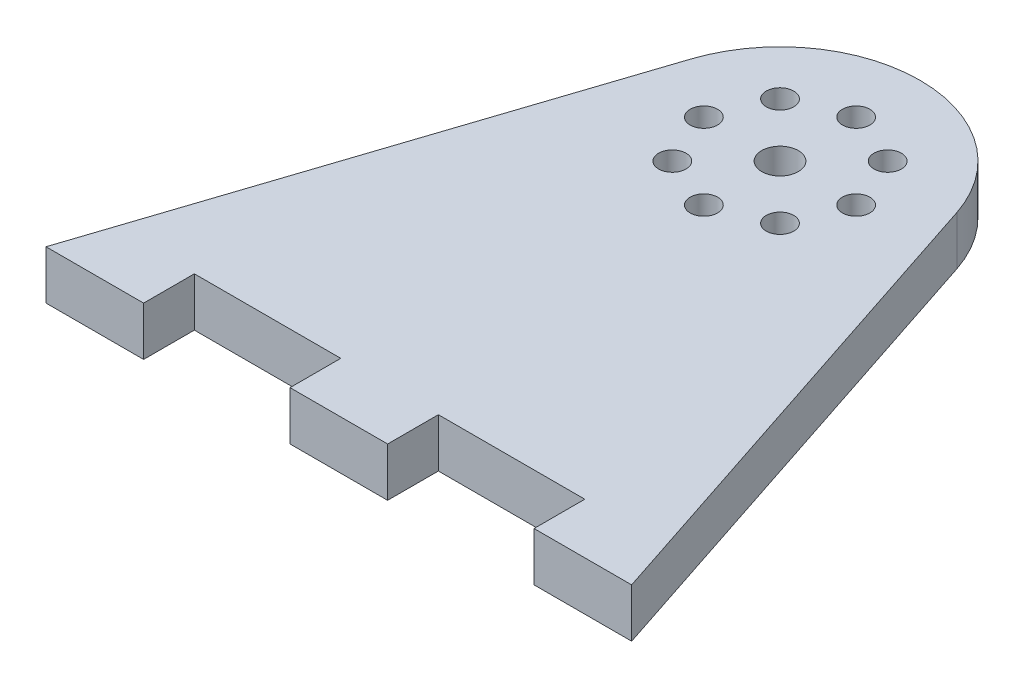
ISO-10303-21;
HEADER;
FILE_DESCRIPTION(('STEP AP214'),'2;1');
FILE_NAME('part.step','',(''),(''),'','','');
FILE_SCHEMA(('AUTOMOTIVE_DESIGN { 1 0 10303 214 1 1 1 1 }'));
ENDSEC;
DATA;
#1=APPLICATION_CONTEXT('core data for automotive mechanical design processes');
#2=APPLICATION_PROTOCOL_DEFINITION('international standard','automotive_design',2000,#1);
#3=PRODUCT_CONTEXT('',#1,'mechanical');
#4=PRODUCT('Part','Part','',(#3));
#5=PRODUCT_RELATED_PRODUCT_CATEGORY('part','',(#4));
#6=PRODUCT_DEFINITION_FORMATION('','',#4);
#7=PRODUCT_DEFINITION_CONTEXT('part definition',#1,'design');
#8=PRODUCT_DEFINITION('design','',#6,#7);
#9=PRODUCT_DEFINITION_SHAPE('','',#8);
#10=(LENGTH_UNIT() NAMED_UNIT(*) SI_UNIT(.MILLI.,.METRE.));
#11=(NAMED_UNIT(*) PLANE_ANGLE_UNIT() SI_UNIT($,.RADIAN.));
#12=(NAMED_UNIT(*) SI_UNIT($,.STERADIAN.) SOLID_ANGLE_UNIT());
#13=UNCERTAINTY_MEASURE_WITH_UNIT(LENGTH_MEASURE(1.E-05),#10,'distance_accuracy_value','');
#14=(GEOMETRIC_REPRESENTATION_CONTEXT(3) GLOBAL_UNCERTAINTY_ASSIGNED_CONTEXT((#13)) GLOBAL_UNIT_ASSIGNED_CONTEXT((#10,
#11,#12)) REPRESENTATION_CONTEXT('',''));
#15=CARTESIAN_POINT('',(0.,0.,0.));
#16=DIRECTION('',(0.,0.,1.));
#17=DIRECTION('',(1.,0.,0.));
#18=AXIS2_PLACEMENT_3D('',#15,#16,#17);
#19=CARTESIAN_POINT('',(0.,6.35,0.));
#20=DIRECTION('',(0.,-1.,0.));
#21=DIRECTION('',(0.,0.,-1.));
#22=AXIS2_PLACEMENT_3D('',#19,#20,#21);
#23=PLANE('',#22);
#24=DIRECTION('',(1.,0.,0.));
#25=VECTOR('',#24,1.);
#26=CARTESIAN_POINT('',(25.4,6.35,50.8));
#27=LINE('',#26,#25);
#28=CARTESIAN_POINT('',(6.35000000000002,6.35,50.8));
#29=VERTEX_POINT('',#28);
#30=CARTESIAN_POINT('',(25.4,6.35,50.8));
#31=VERTEX_POINT('',#30);
#32=EDGE_CURVE('E177',#29,#31,#27,.T.);
#33=ORIENTED_EDGE('',*,*,#32,.T.);
#34=DIRECTION('',(0.,0.,1.));
#35=VECTOR('',#34,1.);
#36=CARTESIAN_POINT('',(25.4,6.35,50.8));
#37=LINE('',#36,#35);
#38=CARTESIAN_POINT('',(25.4,6.35,57.404));
#39=VERTEX_POINT('',#38);
#40=EDGE_CURVE('E105',#31,#39,#37,.T.);
#41=ORIENTED_EDGE('',*,*,#40,.T.);
#42=DIRECTION('',(1.,0.,0.));
#43=VECTOR('',#42,1.);
#44=CARTESIAN_POINT('',(25.4,6.35,57.404));
#45=LINE('',#44,#43);
#46=CARTESIAN_POINT('',(38.1,6.35,57.404));
#47=VERTEX_POINT('',#46);
#48=EDGE_CURVE('E204',#39,#47,#45,.T.);
#49=ORIENTED_EDGE('',*,*,#48,.T.);
#50=DIRECTION('',(-0.312997421123961,0.,-0.949753975706209));
#51=VECTOR('',#50,1.);
#52=CARTESIAN_POINT('',(38.1,6.35,57.404));
#53=LINE('',#52,#51);
#54=CARTESIAN_POINT('',(17.3029242366663,6.35,-5.7022879635253));
#55=VERTEX_POINT('',#54);
#56=EDGE_CURVE('E223',#47,#55,#53,.T.);
#57=ORIENTED_EDGE('',*,*,#56,.T.);
#58=CARTESIAN_POINT('',(0.,6.35,0.));
#59=DIRECTION('',(0.,1.,0.));
#60=DIRECTION('',(0.,0.,-1.));
#61=AXIS2_PLACEMENT_3D('',#58,#59,#60);
#62=CIRCLE('',#61,18.2183225122067);
#63=CARTESIAN_POINT('',(-17.3029242366663,6.35,-5.7022879635253));
#64=VERTEX_POINT('',#63);
#65=EDGE_CURVE('E220',#55,#64,#62,.T.);
#66=ORIENTED_EDGE('',*,*,#65,.T.);
#67=DIRECTION('',(-0.31299742112396,0.,0.949753975706209));
#68=VECTOR('',#67,1.);
#69=CARTESIAN_POINT('',(-38.1,6.35,57.404));
#70=LINE('',#69,#68);
#71=CARTESIAN_POINT('',(-38.1,6.35,57.404));
#72=VERTEX_POINT('',#71);
#73=EDGE_CURVE('E222',#64,#72,#70,.T.);
#74=ORIENTED_EDGE('',*,*,#73,.T.);
#75=DIRECTION('',(1.,0.,0.));
#76=VECTOR('',#75,1.);
#77=CARTESIAN_POINT('',(-38.1,6.35,57.404));
#78=LINE('',#77,#76);
#79=CARTESIAN_POINT('',(-25.4,6.35,57.404));
#80=VERTEX_POINT('',#79);
#81=EDGE_CURVE('E225',#72,#80,#78,.T.);
#82=ORIENTED_EDGE('',*,*,#81,.T.);
#83=DIRECTION('',(0.,0.,-1.));
#84=VECTOR('',#83,1.);
#85=CARTESIAN_POINT('',(-25.4,6.35,50.8));
#86=LINE('',#85,#84);
#87=CARTESIAN_POINT('',(-25.4,6.35,50.8));
#88=VERTEX_POINT('',#87);
#89=EDGE_CURVE('E231',#80,#88,#86,.T.);
#90=ORIENTED_EDGE('',*,*,#89,.T.);
#91=DIRECTION('',(1.,0.,0.));
#92=VECTOR('',#91,1.);
#93=CARTESIAN_POINT('',(-25.4,6.35,50.8));
#94=LINE('',#93,#92);
#95=CARTESIAN_POINT('',(-6.35,6.35,50.8));
#96=VERTEX_POINT('',#95);
#97=EDGE_CURVE('E136',#88,#96,#94,.T.);
#98=ORIENTED_EDGE('',*,*,#97,.T.);
#99=DIRECTION('',(0.,0.,1.));
#100=VECTOR('',#99,1.);
#101=CARTESIAN_POINT('',(-6.35,6.35,50.8));
#102=LINE('',#101,#100);
#103=CARTESIAN_POINT('',(-6.35000000000001,6.35,57.404));
#104=VERTEX_POINT('',#103);
#105=EDGE_CURVE('E130',#96,#104,#102,.T.);
#106=ORIENTED_EDGE('',*,*,#105,.T.);
#107=DIRECTION('',(1.,0.,0.));
#108=VECTOR('',#107,1.);
#109=CARTESIAN_POINT('',(-6.35000000000001,6.35,57.404));
#110=LINE('',#109,#108);
#111=CARTESIAN_POINT('',(6.35000000000002,6.35,57.404));
#112=VERTEX_POINT('',#111);
#113=EDGE_CURVE('E134',#104,#112,#110,.T.);
#114=ORIENTED_EDGE('',*,*,#113,.T.);
#115=DIRECTION('',(0.,0.,-1.));
#116=VECTOR('',#115,1.);
#117=CARTESIAN_POINT('',(6.35000000000002,6.35,50.8));
#118=LINE('',#117,#116);
#119=EDGE_CURVE('E50',#112,#29,#118,.T.);
#120=ORIENTED_EDGE('',*,*,#119,.T.);
#121=EDGE_LOOP('',(#33,#41,#49,#57,#66,#74,#82,#90,#98,#106,#114,#120));
#122=FACE_BOUND('',#121,.T.);
#123=CARTESIAN_POINT('',(0.,6.35,0.));
#124=DIRECTION('',(0.,1.,0.));
#125=DIRECTION('',(0.,0.,1.));
#126=AXIS2_PLACEMENT_3D('',#123,#124,#125);
#127=CIRCLE('',#126,2.38125000000001);
#128=CARTESIAN_POINT('',(0.,6.35,2.38125000000001));
#129=VERTEX_POINT('',#128);
#130=EDGE_CURVE('E158',#129,#129,#127,.T.);
#131=ORIENTED_EDGE('',*,*,#130,.F.);
#132=EDGE_LOOP('',(#131));
#133=FACE_BOUND('',#132,.T.);
#134=CARTESIAN_POINT('',(-9.906,6.35,0.));
#135=DIRECTION('',(0.,1.,0.));
#136=DIRECTION('',(0.,0.,1.));
#137=AXIS2_PLACEMENT_3D('',#134,#135,#136);
#138=CIRCLE('',#137,1.7859375);
#139=CARTESIAN_POINT('',(-9.906,6.35,1.7859375));
#140=VERTEX_POINT('',#139);
#141=EDGE_CURVE('E345',#140,#140,#138,.T.);
#142=ORIENTED_EDGE('',*,*,#141,.F.);
#143=EDGE_LOOP('',(#142));
#144=FACE_BOUND('',#143,.T.);
#145=CARTESIAN_POINT('',(-7.00459977443393,6.35,-7.00459977443395));
#146=DIRECTION('',(0.,1.,0.));
#147=DIRECTION('',(0.,0.,1.));
#148=AXIS2_PLACEMENT_3D('',#145,#146,#147);
#149=CIRCLE('',#148,1.7859375);
#150=CARTESIAN_POINT('',(-7.00459977443393,6.35,-5.21866227443395));
#151=VERTEX_POINT('',#150);
#152=EDGE_CURVE('E339',#151,#151,#149,.T.);
#153=ORIENTED_EDGE('',*,*,#152,.F.);
#154=EDGE_LOOP('',(#153));
#155=FACE_BOUND('',#154,.T.);
#156=CARTESIAN_POINT('',(0.,6.35,-9.906));
#157=DIRECTION('',(0.,1.,0.));
#158=DIRECTION('',(0.,0.,1.));
#159=AXIS2_PLACEMENT_3D('',#156,#157,#158);
#160=CIRCLE('',#159,1.7859375);
#161=CARTESIAN_POINT('',(0.,6.35,-8.1200625));
#162=VERTEX_POINT('',#161);
#163=EDGE_CURVE('E333',#162,#162,#160,.T.);
#164=ORIENTED_EDGE('',*,*,#163,.F.);
#165=EDGE_LOOP('',(#164));
#166=FACE_BOUND('',#165,.T.);
#167=CARTESIAN_POINT('',(7.00459977443398,6.35,-7.0045997744339));
#168=DIRECTION('',(0.,1.,0.));
#169=DIRECTION('',(0.,0.,1.));
#170=AXIS2_PLACEMENT_3D('',#167,#168,#169);
#171=CIRCLE('',#170,1.7859375);
#172=CARTESIAN_POINT('',(7.00459977443398,6.35,-5.2186622744339));
#173=VERTEX_POINT('',#172);
#174=EDGE_CURVE('E327',#173,#173,#171,.T.);
#175=ORIENTED_EDGE('',*,*,#174,.F.);
#176=EDGE_LOOP('',(#175));
#177=FACE_BOUND('',#176,.T.);
#178=CARTESIAN_POINT('',(9.906,6.35,0.));
#179=DIRECTION('',(0.,1.,0.));
#180=DIRECTION('',(0.,0.,1.));
#181=AXIS2_PLACEMENT_3D('',#178,#179,#180);
#182=CIRCLE('',#181,1.7859375);
#183=CARTESIAN_POINT('',(9.906,6.35,1.78593750000007));
#184=VERTEX_POINT('',#183);
#185=EDGE_CURVE('E321',#184,#184,#182,.T.);
#186=ORIENTED_EDGE('',*,*,#185,.F.);
#187=EDGE_LOOP('',(#186));
#188=FACE_BOUND('',#187,.T.);
#189=CARTESIAN_POINT('',(7.00459977443388,6.35,7.004599774434));
#190=DIRECTION('',(0.,1.,0.));
#191=DIRECTION('',(0.,0.,1.));
#192=AXIS2_PLACEMENT_3D('',#189,#190,#191);
#193=CIRCLE('',#192,1.7859375);
#194=CARTESIAN_POINT('',(7.00459977443388,6.35,8.790537274434));
#195=VERTEX_POINT('',#194);
#196=EDGE_CURVE('E315',#195,#195,#193,.T.);
#197=ORIENTED_EDGE('',*,*,#196,.F.);
#198=EDGE_LOOP('',(#197));
#199=FACE_BOUND('',#198,.T.);
#200=CARTESIAN_POINT('',(-1.0375984242774E-13,6.35,9.906));
#201=DIRECTION('',(0.,1.,0.));
#202=DIRECTION('',(0.,0.,1.));
#203=AXIS2_PLACEMENT_3D('',#200,#201,#202);
#204=CIRCLE('',#203,1.7859375);
#205=CARTESIAN_POINT('',(-1.0375984242774E-13,6.35,11.6919375));
#206=VERTEX_POINT('',#205);
#207=EDGE_CURVE('E309',#206,#206,#204,.T.);
#208=ORIENTED_EDGE('',*,*,#207,.F.);
#209=EDGE_LOOP('',(#208));
#210=FACE_BOUND('',#209,.T.);
#211=CARTESIAN_POINT('',(-7.00459977443403,6.35,7.00459977443385));
#212=DIRECTION('',(0.,1.,0.));
#213=DIRECTION('',(0.,0.,1.));
#214=AXIS2_PLACEMENT_3D('',#211,#212,#213);
#215=CIRCLE('',#214,1.7859375);
#216=CARTESIAN_POINT('',(-7.00459977443403,6.35,8.79053727443386));
#217=VERTEX_POINT('',#216);
#218=EDGE_CURVE('E300',#217,#217,#215,.T.);
#219=ORIENTED_EDGE('',*,*,#218,.F.);
#220=EDGE_LOOP('',(#219));
#221=FACE_BOUND('',#220,.T.);
#222=ADVANCED_FACE('F33',(#122,#133,#144,#155,#166,#177,#188,#199,#210,#221),#23,.F.);
#223=CARTESIAN_POINT('',(0.,0.,0.));
#224=DIRECTION('',(0.,-1.,0.));
#225=DIRECTION('',(0.,0.,-1.));
#226=AXIS2_PLACEMENT_3D('',#223,#224,#225);
#227=PLANE('',#226);
#228=CARTESIAN_POINT('',(-1.0375984242774E-13,0.,9.906));
#229=DIRECTION('',(0.,1.,0.));
#230=DIRECTION('',(0.,0.,1.));
#231=AXIS2_PLACEMENT_3D('',#228,#229,#230);
#232=CIRCLE('',#231,1.7859375);
#233=CARTESIAN_POINT('',(-1.0375984242774E-13,0.,11.6919375));
#234=VERTEX_POINT('',#233);
#235=EDGE_CURVE('E306',#234,#234,#232,.T.);
#236=ORIENTED_EDGE('',*,*,#235,.T.);
#237=EDGE_LOOP('',(#236));
#238=FACE_BOUND('',#237,.T.);
#239=CARTESIAN_POINT('',(9.906,0.,0.));
#240=DIRECTION('',(0.,1.,0.));
#241=DIRECTION('',(0.,0.,1.));
#242=AXIS2_PLACEMENT_3D('',#239,#240,#241);
#243=CIRCLE('',#242,1.7859375);
#244=CARTESIAN_POINT('',(9.906,0.,1.78593750000007));
#245=VERTEX_POINT('',#244);
#246=EDGE_CURVE('E318',#245,#245,#243,.T.);
#247=ORIENTED_EDGE('',*,*,#246,.T.);
#248=EDGE_LOOP('',(#247));
#249=FACE_BOUND('',#248,.T.);
#250=CARTESIAN_POINT('',(0.,0.,-9.906));
#251=DIRECTION('',(0.,1.,0.));
#252=DIRECTION('',(0.,0.,1.));
#253=AXIS2_PLACEMENT_3D('',#250,#251,#252);
#254=CIRCLE('',#253,1.7859375);
#255=CARTESIAN_POINT('',(0.,0.,-8.1200625));
#256=VERTEX_POINT('',#255);
#257=EDGE_CURVE('E330',#256,#256,#254,.T.);
#258=ORIENTED_EDGE('',*,*,#257,.T.);
#259=EDGE_LOOP('',(#258));
#260=FACE_BOUND('',#259,.T.);
#261=CARTESIAN_POINT('',(-9.906,0.,0.));
#262=DIRECTION('',(0.,1.,0.));
#263=DIRECTION('',(0.,0.,1.));
#264=AXIS2_PLACEMENT_3D('',#261,#262,#263);
#265=CIRCLE('',#264,1.7859375);
#266=CARTESIAN_POINT('',(-9.906,0.,1.7859375));
#267=VERTEX_POINT('',#266);
#268=EDGE_CURVE('E342',#267,#267,#265,.T.);
#269=ORIENTED_EDGE('',*,*,#268,.T.);
#270=EDGE_LOOP('',(#269));
#271=FACE_BOUND('',#270,.T.);
#272=DIRECTION('',(1.,0.,0.));
#273=VECTOR('',#272,1.);
#274=CARTESIAN_POINT('',(25.4,0.,50.8));
#275=LINE('',#274,#273);
#276=CARTESIAN_POINT('',(6.35000000000002,0.,50.8));
#277=VERTEX_POINT('',#276);
#278=CARTESIAN_POINT('',(25.4,0.,50.8));
#279=VERTEX_POINT('',#278);
#280=EDGE_CURVE('E154',#277,#279,#275,.T.);
#281=ORIENTED_EDGE('',*,*,#280,.F.);
#282=DIRECTION('',(0.,0.,-1.));
#283=VECTOR('',#282,1.);
#284=CARTESIAN_POINT('',(6.35000000000002,0.,50.8));
#285=LINE('',#284,#283);
#286=CARTESIAN_POINT('',(6.35000000000002,0.,57.404));
#287=VERTEX_POINT('',#286);
#288=EDGE_CURVE('E97',#287,#277,#285,.T.);
#289=ORIENTED_EDGE('',*,*,#288,.F.);
#290=DIRECTION('',(1.,0.,0.));
#291=VECTOR('',#290,1.);
#292=CARTESIAN_POINT('',(-6.35000000000001,0.,57.404));
#293=LINE('',#292,#291);
#294=CARTESIAN_POINT('',(-6.35000000000001,0.,57.404));
#295=VERTEX_POINT('',#294);
#296=EDGE_CURVE('E91',#295,#287,#293,.T.);
#297=ORIENTED_EDGE('',*,*,#296,.F.);
#298=DIRECTION('',(0.,0.,1.));
#299=VECTOR('',#298,1.);
#300=CARTESIAN_POINT('',(-6.35,0.,50.8));
#301=LINE('',#300,#299);
#302=CARTESIAN_POINT('',(-6.35,0.,50.8));
#303=VERTEX_POINT('',#302);
#304=EDGE_CURVE('E144',#303,#295,#301,.T.);
#305=ORIENTED_EDGE('',*,*,#304,.F.);
#306=DIRECTION('',(1.,0.,0.));
#307=VECTOR('',#306,1.);
#308=CARTESIAN_POINT('',(-25.4,0.,50.8));
#309=LINE('',#308,#307);
#310=CARTESIAN_POINT('',(-25.4,0.,50.8));
#311=VERTEX_POINT('',#310);
#312=EDGE_CURVE('E172',#311,#303,#309,.T.);
#313=ORIENTED_EDGE('',*,*,#312,.F.);
#314=DIRECTION('',(0.,0.,-1.));
#315=VECTOR('',#314,1.);
#316=CARTESIAN_POINT('',(-25.4,0.,50.8));
#317=LINE('',#316,#315);
#318=CARTESIAN_POINT('',(-25.4,0.,57.404));
#319=VERTEX_POINT('',#318);
#320=EDGE_CURVE('E170',#319,#311,#317,.T.);
#321=ORIENTED_EDGE('',*,*,#320,.F.);
#322=DIRECTION('',(1.,0.,0.));
#323=VECTOR('',#322,1.);
#324=CARTESIAN_POINT('',(-38.1,0.,57.404));
#325=LINE('',#324,#323);
#326=CARTESIAN_POINT('',(-38.1,0.,57.404));
#327=VERTEX_POINT('',#326);
#328=EDGE_CURVE('E168',#327,#319,#325,.T.);
#329=ORIENTED_EDGE('',*,*,#328,.F.);
#330=DIRECTION('',(-0.31299742112396,0.,0.949753975706209));
#331=VECTOR('',#330,1.);
#332=CARTESIAN_POINT('',(-38.1,0.,57.404));
#333=LINE('',#332,#331);
#334=CARTESIAN_POINT('',(-17.3029242366663,0.,-5.7022879635253));
#335=VERTEX_POINT('',#334);
#336=EDGE_CURVE('E166',#335,#327,#333,.T.);
#337=ORIENTED_EDGE('',*,*,#336,.F.);
#338=CARTESIAN_POINT('',(0.,0.,0.));
#339=DIRECTION('',(0.,1.,0.));
#340=DIRECTION('',(0.,0.,-1.));
#341=AXIS2_PLACEMENT_3D('',#338,#339,#340);
#342=CIRCLE('',#341,18.2183225122067);
#343=CARTESIAN_POINT('',(17.3029242366663,0.,-5.7022879635253));
#344=VERTEX_POINT('',#343);
#345=EDGE_CURVE('E164',#344,#335,#342,.T.);
#346=ORIENTED_EDGE('',*,*,#345,.F.);
#347=DIRECTION('',(-0.312997421123961,0.,-0.949753975706209));
#348=VECTOR('',#347,1.);
#349=CARTESIAN_POINT('',(38.1,0.,57.404));
#350=LINE('',#349,#348);
#351=CARTESIAN_POINT('',(38.1,0.,57.404));
#352=VERTEX_POINT('',#351);
#353=EDGE_CURVE('E162',#352,#344,#350,.T.);
#354=ORIENTED_EDGE('',*,*,#353,.F.);
#355=DIRECTION('',(1.,0.,0.));
#356=VECTOR('',#355,1.);
#357=CARTESIAN_POINT('',(25.4,0.,57.404));
#358=LINE('',#357,#356);
#359=CARTESIAN_POINT('',(25.4,0.,57.404));
#360=VERTEX_POINT('',#359);
#361=EDGE_CURVE('E160',#360,#352,#358,.T.);
#362=ORIENTED_EDGE('',*,*,#361,.F.);
#363=DIRECTION('',(0.,0.,1.));
#364=VECTOR('',#363,1.);
#365=CARTESIAN_POINT('',(25.4,0.,50.8));
#366=LINE('',#365,#364);
#367=EDGE_CURVE('E157',#279,#360,#366,.T.);
#368=ORIENTED_EDGE('',*,*,#367,.F.);
#369=EDGE_LOOP('',(#281,#289,#297,#305,#313,#321,#329,#337,#346,#354,#362,#368));
#370=FACE_BOUND('',#369,.T.);
#371=CARTESIAN_POINT('',(0.,0.,0.));
#372=DIRECTION('',(0.,1.,0.));
#373=DIRECTION('',(0.,0.,1.));
#374=AXIS2_PLACEMENT_3D('',#371,#372,#373);
#375=CIRCLE('',#374,2.38125000000001);
#376=CARTESIAN_POINT('',(0.,0.,2.38125000000001));
#377=VERTEX_POINT('',#376);
#378=EDGE_CURVE('E348',#377,#377,#375,.T.);
#379=ORIENTED_EDGE('',*,*,#378,.T.);
#380=EDGE_LOOP('',(#379));
#381=FACE_BOUND('',#380,.T.);
#382=CARTESIAN_POINT('',(-7.00459977443393,0.,-7.00459977443395));
#383=DIRECTION('',(0.,1.,0.));
#384=DIRECTION('',(0.,0.,1.));
#385=AXIS2_PLACEMENT_3D('',#382,#383,#384);
#386=CIRCLE('',#385,1.7859375);
#387=CARTESIAN_POINT('',(-7.00459977443393,0.,-5.21866227443395));
#388=VERTEX_POINT('',#387);
#389=EDGE_CURVE('E336',#388,#388,#386,.T.);
#390=ORIENTED_EDGE('',*,*,#389,.T.);
#391=EDGE_LOOP('',(#390));
#392=FACE_BOUND('',#391,.T.);
#393=CARTESIAN_POINT('',(7.00459977443398,0.,-7.0045997744339));
#394=DIRECTION('',(0.,1.,0.));
#395=DIRECTION('',(0.,0.,1.));
#396=AXIS2_PLACEMENT_3D('',#393,#394,#395);
#397=CIRCLE('',#396,1.7859375);
#398=CARTESIAN_POINT('',(7.00459977443398,0.,-5.2186622744339));
#399=VERTEX_POINT('',#398);
#400=EDGE_CURVE('E324',#399,#399,#397,.T.);
#401=ORIENTED_EDGE('',*,*,#400,.T.);
#402=EDGE_LOOP('',(#401));
#403=FACE_BOUND('',#402,.T.);
#404=CARTESIAN_POINT('',(7.00459977443388,0.,7.004599774434));
#405=DIRECTION('',(0.,1.,0.));
#406=DIRECTION('',(0.,0.,1.));
#407=AXIS2_PLACEMENT_3D('',#404,#405,#406);
#408=CIRCLE('',#407,1.7859375);
#409=CARTESIAN_POINT('',(7.00459977443388,0.,8.790537274434));
#410=VERTEX_POINT('',#409);
#411=EDGE_CURVE('E312',#410,#410,#408,.T.);
#412=ORIENTED_EDGE('',*,*,#411,.T.);
#413=EDGE_LOOP('',(#412));
#414=FACE_BOUND('',#413,.T.);
#415=CARTESIAN_POINT('',(-7.00459977443403,0.,7.00459977443385));
#416=DIRECTION('',(0.,1.,0.));
#417=DIRECTION('',(0.,0.,1.));
#418=AXIS2_PLACEMENT_3D('',#415,#416,#417);
#419=CIRCLE('',#418,1.7859375);
#420=CARTESIAN_POINT('',(-7.00459977443403,0.,8.79053727443386));
#421=VERTEX_POINT('',#420);
#422=EDGE_CURVE('E303',#421,#421,#419,.T.);
#423=ORIENTED_EDGE('',*,*,#422,.T.);
#424=EDGE_LOOP('',(#423));
#425=FACE_BOUND('',#424,.T.);
#426=ADVANCED_FACE('F208',(#238,#249,#260,#271,#370,#381,#392,#403,#414,#425),#227,.T.);
#427=CARTESIAN_POINT('',(25.4,6.35,50.8));
#428=DIRECTION('',(0.,0.,-1.));
#429=DIRECTION('',(-1.,0.,0.));
#430=AXIS2_PLACEMENT_3D('',#427,#428,#429);
#431=PLANE('',#430);
#432=ORIENTED_EDGE('',*,*,#280,.T.);
#433=DIRECTION('',(0.,-1.,0.));
#434=VECTOR('',#433,1.);
#435=CARTESIAN_POINT('',(25.4,6.35,50.8));
#436=LINE('',#435,#434);
#437=EDGE_CURVE('E11',#31,#279,#436,.T.);
#438=ORIENTED_EDGE('',*,*,#437,.F.);
#439=ORIENTED_EDGE('',*,*,#32,.F.);
#440=DIRECTION('',(0.,-1.,0.));
#441=VECTOR('',#440,1.);
#442=CARTESIAN_POINT('',(6.35000000000002,6.35,50.8));
#443=LINE('',#442,#441);
#444=EDGE_CURVE('E150',#29,#277,#443,.T.);
#445=ORIENTED_EDGE('',*,*,#444,.T.);
#446=EDGE_LOOP('',(#432,#438,#439,#445));
#447=FACE_BOUND('',#446,.T.);
#448=ADVANCED_FACE('F35',(#447),#431,.F.);
#449=CARTESIAN_POINT('',(25.4,6.35,50.8));
#450=DIRECTION('',(1.,0.,0.));
#451=DIRECTION('',(0.,0.,-1.));
#452=AXIS2_PLACEMENT_3D('',#449,#450,#451);
#453=PLANE('',#452);
#454=ORIENTED_EDGE('',*,*,#367,.T.);
#455=DIRECTION('',(0.,-1.,0.));
#456=VECTOR('',#455,1.);
#457=CARTESIAN_POINT('',(25.4,6.35,57.404));
#458=LINE('',#457,#456);
#459=EDGE_CURVE('E42',#39,#360,#458,.T.);
#460=ORIENTED_EDGE('',*,*,#459,.F.);
#461=ORIENTED_EDGE('',*,*,#40,.F.);
#462=ORIENTED_EDGE('',*,*,#437,.T.);
#463=EDGE_LOOP('',(#454,#460,#461,#462));
#464=FACE_BOUND('',#463,.T.);
#465=ADVANCED_FACE('F505',(#464),#453,.F.);
#466=CARTESIAN_POINT('',(25.4,6.35,57.404));
#467=DIRECTION('',(0.,0.,-1.));
#468=DIRECTION('',(-1.,0.,0.));
#469=AXIS2_PLACEMENT_3D('',#466,#467,#468);
#470=PLANE('',#469);
#471=ORIENTED_EDGE('',*,*,#361,.T.);
#472=DIRECTION('',(0.,-1.,0.));
#473=VECTOR('',#472,1.);
#474=CARTESIAN_POINT('',(38.1,6.35,57.404));
#475=LINE('',#474,#473);
#476=EDGE_CURVE('E196',#47,#352,#475,.T.);
#477=ORIENTED_EDGE('',*,*,#476,.F.);
#478=ORIENTED_EDGE('',*,*,#48,.F.);
#479=ORIENTED_EDGE('',*,*,#459,.T.);
#480=EDGE_LOOP('',(#471,#477,#478,#479));
#481=FACE_BOUND('',#480,.T.);
#482=ADVANCED_FACE('F202',(#481),#470,.F.);
#483=CARTESIAN_POINT('',(38.1,6.35,57.404));
#484=DIRECTION('',(-0.949753975706209,0.,0.312997421123961));
#485=DIRECTION('',(0.312997421123961,0.,0.949753975706209));
#486=AXIS2_PLACEMENT_3D('',#483,#484,#485);
#487=PLANE('',#486);
#488=ORIENTED_EDGE('',*,*,#353,.T.);
#489=DIRECTION('',(0.,-1.,0.));
#490=VECTOR('',#489,1.);
#491=CARTESIAN_POINT('',(17.3029242366663,6.35,-5.7022879635253));
#492=LINE('',#491,#490);
#493=EDGE_CURVE('E193',#55,#344,#492,.T.);
#494=ORIENTED_EDGE('',*,*,#493,.F.);
#495=ORIENTED_EDGE('',*,*,#56,.F.);
#496=ORIENTED_EDGE('',*,*,#476,.T.);
#497=EDGE_LOOP('',(#488,#494,#495,#496));
#498=FACE_BOUND('',#497,.T.);
#499=ADVANCED_FACE('F214',(#498),#487,.F.);
#500=CARTESIAN_POINT('',(0.,6.35,0.));
#501=DIRECTION('',(0.,-1.,0.));
#502=DIRECTION('',(0.,0.,-1.));
#503=AXIS2_PLACEMENT_3D('',#500,#501,#502);
#504=CYLINDRICAL_SURFACE('',#503,18.2183225122067);
#505=ORIENTED_EDGE('',*,*,#345,.T.);
#506=DIRECTION('',(0.,-1.,0.));
#507=VECTOR('',#506,1.);
#508=CARTESIAN_POINT('',(-17.3029242366663,6.35,-5.7022879635253));
#509=LINE('',#508,#507);
#510=EDGE_CURVE('E190',#64,#335,#509,.T.);
#511=ORIENTED_EDGE('',*,*,#510,.F.);
#512=ORIENTED_EDGE('',*,*,#65,.F.);
#513=ORIENTED_EDGE('',*,*,#493,.T.);
#514=EDGE_LOOP('',(#505,#511,#512,#513));
#515=FACE_BOUND('',#514,.T.);
#516=ADVANCED_FACE('F218',(#515),#504,.T.);
#517=CARTESIAN_POINT('',(-38.1,6.35,57.404));
#518=DIRECTION('',(0.949753975706209,0.,0.31299742112396));
#519=DIRECTION('',(0.312997421123961,0.,-0.949753975706209));
#520=AXIS2_PLACEMENT_3D('',#517,#518,#519);
#521=PLANE('',#520);
#522=ORIENTED_EDGE('',*,*,#336,.T.);
#523=DIRECTION('',(0.,-1.,0.));
#524=VECTOR('',#523,1.);
#525=CARTESIAN_POINT('',(-38.1,6.35,57.404));
#526=LINE('',#525,#524);
#527=EDGE_CURVE('E187',#72,#327,#526,.T.);
#528=ORIENTED_EDGE('',*,*,#527,.F.);
#529=ORIENTED_EDGE('',*,*,#73,.F.);
#530=ORIENTED_EDGE('',*,*,#510,.T.);
#531=EDGE_LOOP('',(#522,#528,#529,#530));
#532=FACE_BOUND('',#531,.T.);
#533=ADVANCED_FACE('F470',(#532),#521,.F.);
#534=CARTESIAN_POINT('',(-38.1,6.35,57.404));
#535=DIRECTION('',(0.,0.,-1.));
#536=DIRECTION('',(-1.,0.,0.));
#537=AXIS2_PLACEMENT_3D('',#534,#535,#536);
#538=PLANE('',#537);
#539=ORIENTED_EDGE('',*,*,#328,.T.);
#540=DIRECTION('',(0.,-1.,0.));
#541=VECTOR('',#540,1.);
#542=CARTESIAN_POINT('',(-25.4,6.35,57.404));
#543=LINE('',#542,#541);
#544=EDGE_CURVE('E184',#80,#319,#543,.T.);
#545=ORIENTED_EDGE('',*,*,#544,.F.);
#546=ORIENTED_EDGE('',*,*,#81,.F.);
#547=ORIENTED_EDGE('',*,*,#527,.T.);
#548=EDGE_LOOP('',(#539,#545,#546,#547));
#549=FACE_BOUND('',#548,.T.);
#550=ADVANCED_FACE('F461',(#549),#538,.F.);
#551=CARTESIAN_POINT('',(-25.4,6.35,50.8));
#552=DIRECTION('',(-1.,0.,0.));
#553=DIRECTION('',(0.,0.,1.));
#554=AXIS2_PLACEMENT_3D('',#551,#552,#553);
#555=PLANE('',#554);
#556=ORIENTED_EDGE('',*,*,#320,.T.);
#557=DIRECTION('',(0.,-1.,0.));
#558=VECTOR('',#557,1.);
#559=CARTESIAN_POINT('',(-25.4,6.35,50.8));
#560=LINE('',#559,#558);
#561=EDGE_CURVE('E181',#88,#311,#560,.T.);
#562=ORIENTED_EDGE('',*,*,#561,.F.);
#563=ORIENTED_EDGE('',*,*,#89,.F.);
#564=ORIENTED_EDGE('',*,*,#544,.T.);
#565=EDGE_LOOP('',(#556,#562,#563,#564));
#566=FACE_BOUND('',#565,.T.);
#567=ADVANCED_FACE('F237',(#566),#555,.F.);
#568=CARTESIAN_POINT('',(-25.4,6.35,50.8));
#569=DIRECTION('',(0.,0.,-1.));
#570=DIRECTION('',(-1.,0.,0.));
#571=AXIS2_PLACEMENT_3D('',#568,#569,#570);
#572=PLANE('',#571);
#573=ORIENTED_EDGE('',*,*,#312,.T.);
#574=DIRECTION('',(0.,-1.,0.));
#575=VECTOR('',#574,1.);
#576=CARTESIAN_POINT('',(-6.35,6.35,50.8));
#577=LINE('',#576,#575);
#578=EDGE_CURVE('E145',#96,#303,#577,.T.);
#579=ORIENTED_EDGE('',*,*,#578,.F.);
#580=ORIENTED_EDGE('',*,*,#97,.F.);
#581=ORIENTED_EDGE('',*,*,#561,.T.);
#582=EDGE_LOOP('',(#573,#579,#580,#581));
#583=FACE_BOUND('',#582,.T.);
#584=ADVANCED_FACE('F241',(#583),#572,.F.);
#585=CARTESIAN_POINT('',(-6.35,6.35,50.8));
#586=DIRECTION('',(1.,0.,0.));
#587=DIRECTION('',(0.,0.,-1.));
#588=AXIS2_PLACEMENT_3D('',#585,#586,#587);
#589=PLANE('',#588);
#590=ORIENTED_EDGE('',*,*,#304,.T.);
#591=DIRECTION('',(0.,-1.,0.));
#592=VECTOR('',#591,1.);
#593=CARTESIAN_POINT('',(-6.35000000000001,6.35,57.404));
#594=LINE('',#593,#592);
#595=EDGE_CURVE('E141',#104,#295,#594,.T.);
#596=ORIENTED_EDGE('',*,*,#595,.F.);
#597=ORIENTED_EDGE('',*,*,#105,.F.);
#598=ORIENTED_EDGE('',*,*,#578,.T.);
#599=EDGE_LOOP('',(#590,#596,#597,#598));
#600=FACE_BOUND('',#599,.T.);
#601=ADVANCED_FACE('F142',(#600),#589,.F.);
#602=CARTESIAN_POINT('',(-6.35000000000001,6.35,57.404));
#603=DIRECTION('',(0.,0.,-1.));
#604=DIRECTION('',(-1.,0.,0.));
#605=AXIS2_PLACEMENT_3D('',#602,#603,#604);
#606=PLANE('',#605);
#607=ORIENTED_EDGE('',*,*,#296,.T.);
#608=DIRECTION('',(0.,-1.,0.));
#609=VECTOR('',#608,1.);
#610=CARTESIAN_POINT('',(6.35000000000002,6.35,57.404));
#611=LINE('',#610,#609);
#612=EDGE_CURVE('E146',#112,#287,#611,.T.);
#613=ORIENTED_EDGE('',*,*,#612,.F.);
#614=ORIENTED_EDGE('',*,*,#113,.F.);
#615=ORIENTED_EDGE('',*,*,#595,.T.);
#616=EDGE_LOOP('',(#607,#613,#614,#615));
#617=FACE_BOUND('',#616,.T.);
#618=ADVANCED_FACE('F148',(#617),#606,.F.);
#619=CARTESIAN_POINT('',(6.35000000000002,6.35,50.8));
#620=DIRECTION('',(-1.,0.,0.));
#621=DIRECTION('',(0.,0.,1.));
#622=AXIS2_PLACEMENT_3D('',#619,#620,#621);
#623=PLANE('',#622);
#624=ORIENTED_EDGE('',*,*,#288,.T.);
#625=ORIENTED_EDGE('',*,*,#444,.F.);
#626=ORIENTED_EDGE('',*,*,#119,.F.);
#627=ORIENTED_EDGE('',*,*,#612,.T.);
#628=EDGE_LOOP('',(#624,#625,#626,#627));
#629=FACE_BOUND('',#628,.T.);
#630=ADVANCED_FACE('F245',(#629),#623,.F.);
#631=CARTESIAN_POINT('',(0.,6.35,0.));
#632=DIRECTION('',(0.,-1.,0.));
#633=DIRECTION('',(0.,0.,-1.));
#634=AXIS2_PLACEMENT_3D('',#631,#632,#633);
#635=CYLINDRICAL_SURFACE('',#634,2.38125000000001);
#636=ORIENTED_EDGE('',*,*,#130,.T.);
#637=EDGE_LOOP('',(#636));
#638=FACE_BOUND('',#637,.T.);
#639=ORIENTED_EDGE('',*,*,#378,.F.);
#640=EDGE_LOOP('',(#639));
#641=FACE_BOUND('',#640,.T.);
#642=ADVANCED_FACE('F247',(#638,#641),#635,.F.);
#643=CARTESIAN_POINT('',(-9.906,6.35,0.));
#644=DIRECTION('',(0.,-1.,0.));
#645=DIRECTION('',(0.,0.,-1.));
#646=AXIS2_PLACEMENT_3D('',#643,#644,#645);
#647=CYLINDRICAL_SURFACE('',#646,1.7859375);
#648=ORIENTED_EDGE('',*,*,#141,.T.);
#649=EDGE_LOOP('',(#648));
#650=FACE_BOUND('',#649,.T.);
#651=ORIENTED_EDGE('',*,*,#268,.F.);
#652=EDGE_LOOP('',(#651));
#653=FACE_BOUND('',#652,.T.);
#654=ADVANCED_FACE('F253',(#650,#653),#647,.F.);
#655=CARTESIAN_POINT('',(-7.00459977443393,6.35,-7.00459977443395));
#656=DIRECTION('',(0.,-1.,0.));
#657=DIRECTION('',(0.,0.,-1.));
#658=AXIS2_PLACEMENT_3D('',#655,#656,#657);
#659=CYLINDRICAL_SURFACE('',#658,1.7859375);
#660=ORIENTED_EDGE('',*,*,#152,.T.);
#661=EDGE_LOOP('',(#660));
#662=FACE_BOUND('',#661,.T.);
#663=ORIENTED_EDGE('',*,*,#389,.F.);
#664=EDGE_LOOP('',(#663));
#665=FACE_BOUND('',#664,.T.);
#666=ADVANCED_FACE('F267',(#662,#665),#659,.F.);
#667=CARTESIAN_POINT('',(0.,6.35,-9.906));
#668=DIRECTION('',(0.,-1.,0.));
#669=DIRECTION('',(0.,0.,-1.));
#670=AXIS2_PLACEMENT_3D('',#667,#668,#669);
#671=CYLINDRICAL_SURFACE('',#670,1.7859375);
#672=ORIENTED_EDGE('',*,*,#163,.T.);
#673=EDGE_LOOP('',(#672));
#674=FACE_BOUND('',#673,.T.);
#675=ORIENTED_EDGE('',*,*,#257,.F.);
#676=EDGE_LOOP('',(#675));
#677=FACE_BOUND('',#676,.T.);
#678=ADVANCED_FACE('F271',(#674,#677),#671,.F.);
#679=CARTESIAN_POINT('',(7.00459977443398,6.35,-7.0045997744339));
#680=DIRECTION('',(0.,-1.,0.));
#681=DIRECTION('',(0.,0.,-1.));
#682=AXIS2_PLACEMENT_3D('',#679,#680,#681);
#683=CYLINDRICAL_SURFACE('',#682,1.7859375);
#684=ORIENTED_EDGE('',*,*,#174,.T.);
#685=EDGE_LOOP('',(#684));
#686=FACE_BOUND('',#685,.T.);
#687=ORIENTED_EDGE('',*,*,#400,.F.);
#688=EDGE_LOOP('',(#687));
#689=FACE_BOUND('',#688,.T.);
#690=ADVANCED_FACE('F275',(#686,#689),#683,.F.);
#691=CARTESIAN_POINT('',(9.906,6.35,0.));
#692=DIRECTION('',(0.,-1.,0.));
#693=DIRECTION('',(0.,0.,-1.));
#694=AXIS2_PLACEMENT_3D('',#691,#692,#693);
#695=CYLINDRICAL_SURFACE('',#694,1.7859375);
#696=ORIENTED_EDGE('',*,*,#185,.T.);
#697=EDGE_LOOP('',(#696));
#698=FACE_BOUND('',#697,.T.);
#699=ORIENTED_EDGE('',*,*,#246,.F.);
#700=EDGE_LOOP('',(#699));
#701=FACE_BOUND('',#700,.T.);
#702=ADVANCED_FACE('F279',(#698,#701),#695,.F.);
#703=CARTESIAN_POINT('',(7.00459977443388,6.35,7.004599774434));
#704=DIRECTION('',(0.,-1.,0.));
#705=DIRECTION('',(0.,0.,-1.));
#706=AXIS2_PLACEMENT_3D('',#703,#704,#705);
#707=CYLINDRICAL_SURFACE('',#706,1.7859375);
#708=ORIENTED_EDGE('',*,*,#196,.T.);
#709=EDGE_LOOP('',(#708));
#710=FACE_BOUND('',#709,.T.);
#711=ORIENTED_EDGE('',*,*,#411,.F.);
#712=EDGE_LOOP('',(#711));
#713=FACE_BOUND('',#712,.T.);
#714=ADVANCED_FACE('F283',(#710,#713),#707,.F.);
#715=CARTESIAN_POINT('',(-1.0375984242774E-13,6.35,9.906));
#716=DIRECTION('',(0.,-1.,0.));
#717=DIRECTION('',(0.,0.,-1.));
#718=AXIS2_PLACEMENT_3D('',#715,#716,#717);
#719=CYLINDRICAL_SURFACE('',#718,1.7859375);
#720=ORIENTED_EDGE('',*,*,#207,.T.);
#721=EDGE_LOOP('',(#720));
#722=FACE_BOUND('',#721,.T.);
#723=ORIENTED_EDGE('',*,*,#235,.F.);
#724=EDGE_LOOP('',(#723));
#725=FACE_BOUND('',#724,.T.);
#726=ADVANCED_FACE('F287',(#722,#725),#719,.F.);
#727=CARTESIAN_POINT('',(-7.00459977443403,6.35,7.00459977443385));
#728=DIRECTION('',(0.,-1.,0.));
#729=DIRECTION('',(0.,0.,-1.));
#730=AXIS2_PLACEMENT_3D('',#727,#728,#729);
#731=CYLINDRICAL_SURFACE('',#730,1.7859375);
#732=ORIENTED_EDGE('',*,*,#218,.T.);
#733=EDGE_LOOP('',(#732));
#734=FACE_BOUND('',#733,.T.);
#735=ORIENTED_EDGE('',*,*,#422,.F.);
#736=EDGE_LOOP('',(#735));
#737=FACE_BOUND('',#736,.T.);
#738=ADVANCED_FACE('F291',(#734,#737),#731,.F.);
#739=CLOSED_SHELL('',(#222,#426,#448,#465,#482,#499,#516,#533,#550,#567,#584,#601,#618,#630,
#642,#654,#666,#678,#690,#702,#714,#726,#738));
#740=MANIFOLD_SOLID_BREP('B2',#739);
#741=ADVANCED_BREP_SHAPE_REPRESENTATION('',(#18,#740),#14);
#742=SHAPE_DEFINITION_REPRESENTATION(#9,#741);
ENDSEC;
END-ISO-10303-21;
